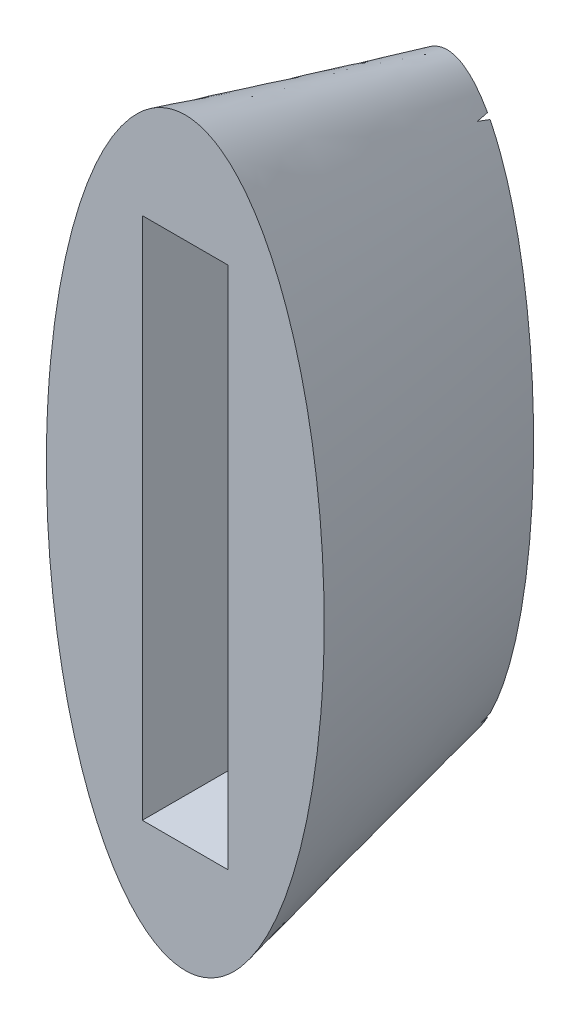
ISO-10303-21;
HEADER;
FILE_DESCRIPTION(('STEP AP214'),'2;1');
FILE_NAME('part.step','',(''),(''),'','','');
FILE_SCHEMA(('AUTOMOTIVE_DESIGN { 1 0 10303 214 1 1 1 1 }'));
ENDSEC;
DATA;
#1=APPLICATION_CONTEXT('core data for automotive mechanical design processes');
#2=APPLICATION_PROTOCOL_DEFINITION('international standard','automotive_design',2000,#1);
#3=PRODUCT_CONTEXT('',#1,'mechanical');
#4=PRODUCT('Part','Part','',(#3));
#5=PRODUCT_RELATED_PRODUCT_CATEGORY('part','',(#4));
#6=PRODUCT_DEFINITION_FORMATION('','',#4);
#7=PRODUCT_DEFINITION_CONTEXT('part definition',#1,'design');
#8=PRODUCT_DEFINITION('design','',#6,#7);
#9=PRODUCT_DEFINITION_SHAPE('','',#8);
#10=(LENGTH_UNIT() NAMED_UNIT(*) SI_UNIT(.MILLI.,.METRE.));
#11=(NAMED_UNIT(*) PLANE_ANGLE_UNIT() SI_UNIT($,.RADIAN.));
#12=(NAMED_UNIT(*) SI_UNIT($,.STERADIAN.) SOLID_ANGLE_UNIT());
#13=UNCERTAINTY_MEASURE_WITH_UNIT(LENGTH_MEASURE(1.E-05),#10,'distance_accuracy_value','');
#14=(GEOMETRIC_REPRESENTATION_CONTEXT(3) GLOBAL_UNCERTAINTY_ASSIGNED_CONTEXT((#13)) GLOBAL_UNIT_ASSIGNED_CONTEXT((#10,
#11,#12)) REPRESENTATION_CONTEXT('',''));
#15=CARTESIAN_POINT('',(0.,0.,0.));
#16=DIRECTION('',(0.,0.,1.));
#17=DIRECTION('',(1.,0.,0.));
#18=AXIS2_PLACEMENT_3D('',#15,#16,#17);
#19=CARTESIAN_POINT('',(0.,0.,-12.5));
#20=DIRECTION('',(0.,0.,1.));
#21=DIRECTION('',(1.,0.,0.));
#22=AXIS2_PLACEMENT_3D('',#19,#20,#21);
#23=PLANE('',#22);
#24=CARTESIAN_POINT('',(0.,0.,-12.5));
#25=DIRECTION('',(0.,0.,1.));
#26=DIRECTION('',(0.,1.,0.));
#27=AXIS2_PLACEMENT_3D('',#24,#25,#26);
#28=ELLIPSE('',#27,14.1372,4.130055);
#29=CARTESIAN_POINT('',(2.05,-12.2727270886609,-12.5));
#30=VERTEX_POINT('',#29);
#31=CARTESIAN_POINT('',(2.05,12.2727290489737,-12.5));
#32=VERTEX_POINT('',#31);
#33=EDGE_CURVE('E298',#30,#32,#28,.T.);
#34=ORIENTED_EDGE('',*,*,#33,.F.);
#35=DIRECTION('',(0.,1.,0.));
#36=VECTOR('',#35,1.);
#37=CARTESIAN_POINT('',(2.05,0.,-12.5));
#38=LINE('',#37,#36);
#39=EDGE_CURVE('E172',#30,#32,#38,.T.);
#40=ORIENTED_EDGE('',*,*,#39,.T.);
#41=EDGE_LOOP('',(#34,#40));
#42=FACE_BOUND('',#41,.T.);
#43=ADVANCED_FACE('F53',(#42),#23,.F.);
#44=CARTESIAN_POINT('',(-1.92924399157803,-12.5,-12.5));
#45=VERTEX_POINT('',#44);
#46=CARTESIAN_POINT('',(1.92924590420982,-12.5,-12.5));
#47=VERTEX_POINT('',#46);
#48=EDGE_CURVE('E307',#45,#47,#28,.T.);
#49=ORIENTED_EDGE('',*,*,#48,.F.);
#50=DIRECTION('',(1.,0.,0.));
#51=VECTOR('',#50,1.);
#52=CARTESIAN_POINT('',(0.,-12.5,-12.5));
#53=LINE('',#52,#51);
#54=EDGE_CURVE('E166',#45,#47,#53,.T.);
#55=ORIENTED_EDGE('',*,*,#54,.T.);
#56=EDGE_LOOP('',(#49,#55));
#57=FACE_BOUND('',#56,.T.);
#58=ADVANCED_FACE('F352',(#57),#23,.F.);
#59=CARTESIAN_POINT('',(-2.05,12.2727270886608,-12.5));
#60=VERTEX_POINT('',#59);
#61=CARTESIAN_POINT('',(-2.05,-12.2727290489737,-12.5));
#62=VERTEX_POINT('',#61);
#63=EDGE_CURVE('E58',#60,#62,#28,.T.);
#64=ORIENTED_EDGE('',*,*,#63,.F.);
#65=DIRECTION('',(0.,-1.,0.));
#66=VECTOR('',#65,1.);
#67=CARTESIAN_POINT('',(-2.05,0.,-12.5));
#68=LINE('',#67,#66);
#69=EDGE_CURVE('E160',#60,#62,#68,.T.);
#70=ORIENTED_EDGE('',*,*,#69,.T.);
#71=EDGE_LOOP('',(#64,#70));
#72=FACE_BOUND('',#71,.T.);
#73=ADVANCED_FACE('F354',(#72),#23,.F.);
#74=CARTESIAN_POINT('',(0.,0.,0.));
#75=DIRECTION('',(0.,0.,1.));
#76=DIRECTION('',(1.,0.,0.));
#77=AXIS2_PLACEMENT_3D('',#74,#75,#76);
#78=PLANE('',#77);
#79=DIRECTION('',(0.,1.,0.));
#80=VECTOR('',#79,1.);
#81=CARTESIAN_POINT('',(2.05,12.5,0.));
#82=LINE('',#81,#80);
#83=CARTESIAN_POINT('',(2.05,-12.5,0.));
#84=VERTEX_POINT('',#83);
#85=CARTESIAN_POINT('',(2.05,12.5,0.));
#86=VERTEX_POINT('',#85);
#87=EDGE_CURVE('E73',#84,#86,#82,.T.);
#88=ORIENTED_EDGE('',*,*,#87,.F.);
#89=DIRECTION('',(1.,0.,0.));
#90=VECTOR('',#89,1.);
#91=CARTESIAN_POINT('',(-2.05,-12.5,0.));
#92=LINE('',#91,#90);
#93=CARTESIAN_POINT('',(-2.05,-12.5,0.));
#94=VERTEX_POINT('',#93);
#95=EDGE_CURVE('E142',#94,#84,#92,.T.);
#96=ORIENTED_EDGE('',*,*,#95,.F.);
#97=DIRECTION('',(0.,-1.,0.));
#98=VECTOR('',#97,1.);
#99=CARTESIAN_POINT('',(-2.05,12.5,0.));
#100=LINE('',#99,#98);
#101=CARTESIAN_POINT('',(-2.05,12.5,0.));
#102=VERTEX_POINT('',#101);
#103=EDGE_CURVE('E125',#102,#94,#100,.T.);
#104=ORIENTED_EDGE('',*,*,#103,.F.);
#105=DIRECTION('',(-1.,0.,0.));
#106=VECTOR('',#105,1.);
#107=CARTESIAN_POINT('',(-2.05,12.5,0.));
#108=LINE('',#107,#106);
#109=EDGE_CURVE('E135',#86,#102,#108,.T.);
#110=ORIENTED_EDGE('',*,*,#109,.F.);
#111=EDGE_LOOP('',(#88,#96,#104,#110));
#112=FACE_BOUND('',#111,.T.);
#113=CARTESIAN_POINT('',(0.,0.,0.));
#114=DIRECTION('',(0.,0.,1.));
#115=DIRECTION('',(0.,1.,0.));
#116=AXIS2_PLACEMENT_3D('',#113,#114,#115);
#117=ELLIPSE('',#116,17.6875,6.630055);
#118=CARTESIAN_POINT('',(0.,17.6875,0.));
#119=VERTEX_POINT('',#118);
#120=EDGE_CURVE('E311',#119,#119,#117,.T.);
#121=ORIENTED_EDGE('',*,*,#120,.T.);
#122=EDGE_LOOP('',(#121));
#123=FACE_BOUND('',#122,.T.);
#124=ADVANCED_FACE('F55',(#112,#123),#78,.T.);
#125=CARTESIAN_POINT('',(1.92924399157938,12.5,-12.5));
#126=VERTEX_POINT('',#125);
#127=CARTESIAN_POINT('',(-1.92924590420982,12.5,-12.5));
#128=VERTEX_POINT('',#127);
#129=EDGE_CURVE('E294',#126,#128,#28,.T.);
#130=ORIENTED_EDGE('',*,*,#129,.F.);
#131=DIRECTION('',(-1.,0.,0.));
#132=VECTOR('',#131,1.);
#133=CARTESIAN_POINT('',(0.,12.5,-12.5));
#134=LINE('',#133,#132);
#135=EDGE_CURVE('E152',#126,#128,#134,.T.);
#136=ORIENTED_EDGE('',*,*,#135,.T.);
#137=EDGE_LOOP('',(#130,#136));
#138=FACE_BOUND('',#137,.T.);
#139=ADVANCED_FACE('F200',(#138),#23,.F.);
#140=CARTESIAN_POINT('',(-4.08279544173566,2.13255064071059,-12.5));
#141=CARTESIAN_POINT('',(-6.62728594040557,-0.511144492392694,0.));
#142=CARTESIAN_POINT('',(-5.32880617036933,-25.8183099259914,-12.5));
#143=CARTESIAN_POINT('',(-6.24408694704747,-35.8713700322784,0.));
#144=CARTESIAN_POINT('',(2.83678471310198,-30.0834112074126,-12.5));
#145=CARTESIAN_POINT('',(7.01048493376367,-34.849081047493,0.));
#146=CARTESIAN_POINT('',(4.08279544173566,-2.13255064071059,-12.5));
#147=CARTESIAN_POINT('',(6.62728594040557,0.511144492392696,0.));
#148=CARTESIAN_POINT('',(5.32880617036933,25.8183099259914,-12.5));
#149=CARTESIAN_POINT('',(6.24408694704747,35.8713700322784,0.));
#150=CARTESIAN_POINT('',(-2.83678471310199,30.0834112074126,-12.5));
#151=CARTESIAN_POINT('',(-7.01048493376367,34.849081047493,0.));
#152=CARTESIAN_POINT('',(-4.08279544173566,2.13255064071059,-12.5));
#153=CARTESIAN_POINT('',(-6.62728594040557,-0.511144492392694,0.));
#154=(BOUNDED_SURFACE() B_SPLINE_SURFACE(3,1,((#140,#141),(#142,#143),(#144,#145),(#146,#147),
(#148,#149),(#150,#151),(#152,#153)),.UNSPECIFIED.,.T.,.F.,.F.) B_SPLINE_SURFACE_WITH_KNOTS((4,
3,4),(2,2),(0.,0.5,1.),(0.,1.),
.UNSPECIFIED.) GEOMETRIC_REPRESENTATION_ITEM() RATIONAL_B_SPLINE_SURFACE(((1.,1.),
(0.333333333333333,0.333333333333333),(0.333333333333333,0.333333333333333),(1.,1.),
(0.333333333333333,0.333333333333333),(0.333333333333333,0.333333333333333),(1.,1.))) REPRESENTATION_ITEM('') SURFACE());
#155=CARTESIAN_POINT('',(2.05,-12.2727290489736,-12.5));
#156=CARTESIAN_POINT('',(2.05,-12.3111027775344,-12.4143688326618));
#157=CARTESIAN_POINT('',(2.05,-12.3492288877336,-12.3286284114438));
#158=CARTESIAN_POINT('',(2.05,-12.424985871409,-12.1569290612481));
#159=CARTESIAN_POINT('',(2.05,-12.4626167448853,-12.0709701322705));
#160=CARTESIAN_POINT('',(2.05,-12.5,-11.984901949413));
#161=B_SPLINE_CURVE_WITH_KNOTS('',3,(#155,#156,#157,#158,#159,#160),.UNSPECIFIED.,.F.,.F.,(4,2,
4),(0.,0.281505205966259,0.563010411932515),.UNSPECIFIED.);
#162=CARTESIAN_POINT('',(2.05,-12.5,-11.984901949413));
#163=VERTEX_POINT('',#162);
#164=EDGE_CURVE('E12',#30,#163,#161,.T.);
#165=CARTESIAN_POINT('',(2.05,12.5,-11.8953005782408));
#166=CARTESIAN_POINT('',(2.05,12.4622153813034,-11.9961190965939));
#167=CARTESIAN_POINT('',(2.05,12.4243838260362,-12.0969199742503));
#168=CARTESIAN_POINT('',(2.05,12.3486268423607,-12.29848644817));
#169=CARTESIAN_POINT('',(2.05,12.3107014139525,-12.3992520444333));
#170=CARTESIAN_POINT('',(2.05,12.2727290489737,-12.5));
#171=B_SPLINE_CURVE_WITH_KNOTS('',3,(#165,#166,#167,#168,#169,#170),.UNSPECIFIED.,.F.,.F.,(4,2,
4),(0.,0.322999058190885,0.645998116381772),.UNSPECIFIED.);
#172=CARTESIAN_POINT('',(2.05,12.5,-11.8953005782408));
#173=VERTEX_POINT('',#172);
#174=EDGE_CURVE('E327',#173,#32,#171,.T.);
#175=CARTESIAN_POINT('',(1.92924590420982,12.5,-12.5));
#176=CARTESIAN_POINT('',(1.94925491746777,12.5,-12.399193465011));
#177=CARTESIAN_POINT('',(1.9693222654126,12.5,-12.2983985790366));
#178=CARTESIAN_POINT('',(2.00957363067599,12.5,-12.0968321051169));
#179=CARTESIAN_POINT('',(2.02975764799456,12.5,-11.9960605171716));
#180=CARTESIAN_POINT('',(2.05,12.5,-11.8953005782408));
#181=B_SPLINE_CURVE_WITH_KNOTS('',3,(#175,#176,#177,#178,#179,#180),.UNSPECIFIED.,.F.,.F.,(4,2,
4),(0.,0.308319262176751,0.616638524353501),.UNSPECIFIED.);
#182=EDGE_CURVE('E342',#126,#173,#181,.T.);
#183=CARTESIAN_POINT('',(-2.05,12.5,-11.984901949413));
#184=CARTESIAN_POINT('',(-2.02996878243648,12.5,-12.0707737698944));
#185=CARTESIAN_POINT('',(-2.00989033233887,12.5,-12.156634517684));
#186=CARTESIAN_POINT('',(-1.96963896707547,12.5,-12.3283338678796));
#187=CARTESIAN_POINT('',(-1.94946605190969,12.5,-12.4141724702857));
#188=CARTESIAN_POINT('',(-1.92924590420982,12.5,-12.5));
#189=B_SPLINE_CURVE_WITH_KNOTS('',3,(#183,#184,#185,#186,#187,#188),.UNSPECIFIED.,.F.,.F.,(4,2,
4),(0.,0.264531490608989,0.52906298121798),.UNSPECIFIED.);
#190=CARTESIAN_POINT('',(-2.05,12.5,-11.984901949413));
#191=VERTEX_POINT('',#190);
#192=EDGE_CURVE('E318',#191,#128,#189,.T.);
#193=CARTESIAN_POINT('',(-2.05,12.2727290489737,-12.5));
#194=CARTESIAN_POINT('',(-2.05,12.3111027775344,-12.4143688326618));
#195=CARTESIAN_POINT('',(-2.05,12.3492288877336,-12.3286284114438));
#196=CARTESIAN_POINT('',(-2.05,12.424985871409,-12.1569290612481));
#197=CARTESIAN_POINT('',(-2.05,12.4626167448853,-12.0709701322705));
#198=CARTESIAN_POINT('',(-2.05,12.5,-11.984901949413));
#199=B_SPLINE_CURVE_WITH_KNOTS('',3,(#193,#194,#195,#196,#197,#198),.UNSPECIFIED.,.F.,.F.,(4,2,
4),(0.,0.281505205966247,0.563010411932495),.UNSPECIFIED.);
#200=EDGE_CURVE('E128',#60,#191,#199,.T.);
#201=CARTESIAN_POINT('',(-2.05,-12.5,-11.8953005782408));
#202=CARTESIAN_POINT('',(-2.05,-12.4622153813034,-11.9961190965938));
#203=CARTESIAN_POINT('',(-2.05,-12.4243838260362,-12.0969199742503));
#204=CARTESIAN_POINT('',(-2.05,-12.3486268423607,-12.29848644817));
#205=CARTESIAN_POINT('',(-2.05,-12.3107014139525,-12.3992520444333));
#206=CARTESIAN_POINT('',(-2.05,-12.2727290489737,-12.5));
#207=B_SPLINE_CURVE_WITH_KNOTS('',3,(#201,#202,#203,#204,#205,#206),.UNSPECIFIED.,.F.,.F.,(4,2,
4),(0.,0.322999058190903,0.645998116381806),.UNSPECIFIED.);
#208=CARTESIAN_POINT('',(-2.05,-12.5,-11.8953005782408));
#209=VERTEX_POINT('',#208);
#210=EDGE_CURVE('E345',#209,#62,#207,.T.);
#211=CARTESIAN_POINT('',(-1.92924590420982,-12.5,-12.5));
#212=CARTESIAN_POINT('',(-1.94925491746777,-12.5,-12.399193465011));
#213=CARTESIAN_POINT('',(-1.9693222654126,-12.5,-12.2983985790366));
#214=CARTESIAN_POINT('',(-2.00957363067599,-12.5,-12.0968321051169));
#215=CARTESIAN_POINT('',(-2.02975764799456,-12.5,-11.9960605171715));
#216=CARTESIAN_POINT('',(-2.05,-12.5,-11.8953005782408));
#217=B_SPLINE_CURVE_WITH_KNOTS('',3,(#211,#212,#213,#214,#215,#216),.UNSPECIFIED.,.F.,.F.,(4,2,
4),(0.,0.308319262176767,0.616638524353531),.UNSPECIFIED.);
#218=EDGE_CURVE('E347',#45,#209,#217,.T.);
#219=CARTESIAN_POINT('',(2.05,-12.5,-11.984901949413));
#220=CARTESIAN_POINT('',(2.02996878243648,-12.5,-12.0707737698943));
#221=CARTESIAN_POINT('',(2.00989033233887,-12.5,-12.156634517684));
#222=CARTESIAN_POINT('',(1.96963896707547,-12.5,-12.3283338678796));
#223=CARTESIAN_POINT('',(1.94946605190969,-12.5,-12.4141724702857));
#224=CARTESIAN_POINT('',(1.92924590420982,-12.5,-12.5));
#225=B_SPLINE_CURVE_WITH_KNOTS('',3,(#219,#220,#221,#222,#223,#224),.UNSPECIFIED.,.F.,.F.,(4,2,
4),(0.,0.264531490608999,0.529062981217999),.UNSPECIFIED.);
#226=EDGE_CURVE('E65',#163,#47,#225,.T.);
#227=ORIENTED_EDGE('',*,*,#164,.F.);
#228=ORIENTED_EDGE('',*,*,#33,.T.);
#229=ORIENTED_EDGE('',*,*,#174,.F.);
#230=ORIENTED_EDGE('',*,*,#182,.F.);
#231=ORIENTED_EDGE('',*,*,#129,.T.);
#232=ORIENTED_EDGE('',*,*,#192,.F.);
#233=ORIENTED_EDGE('',*,*,#200,.F.);
#234=ORIENTED_EDGE('',*,*,#63,.T.);
#235=ORIENTED_EDGE('',*,*,#210,.F.);
#236=ORIENTED_EDGE('',*,*,#218,.F.);
#237=ORIENTED_EDGE('',*,*,#48,.T.);
#238=ORIENTED_EDGE('',*,*,#226,.F.);
#239=EDGE_LOOP('',(#227,#228,#229,#230,#231,#232,#233,#234,#235,#236,#237,#238));
#240=FACE_BOUND('',#239,.T.);
#241=ORIENTED_EDGE('',*,*,#120,.F.);
#242=EDGE_LOOP('',(#241));
#243=FACE_BOUND('',#242,.T.);
#244=ADVANCED_FACE('F188',(#240,#243),#154,.T.);
#245=CARTESIAN_POINT('',(2.05,12.5,-20.));
#246=DIRECTION('',(1.,0.,0.));
#247=DIRECTION('',(0.,1.,0.));
#248=AXIS2_PLACEMENT_3D('',#245,#246,#247);
#249=PLANE('',#248);
#250=ORIENTED_EDGE('',*,*,#164,.T.);
#251=DIRECTION('',(0.,0.,1.));
#252=VECTOR('',#251,1.);
#253=CARTESIAN_POINT('',(2.05,-12.5,-20.));
#254=LINE('',#253,#252);
#255=EDGE_CURVE('E149',#163,#84,#254,.T.);
#256=ORIENTED_EDGE('',*,*,#255,.T.);
#257=ORIENTED_EDGE('',*,*,#87,.T.);
#258=DIRECTION('',(0.,0.,1.));
#259=VECTOR('',#258,1.);
#260=CARTESIAN_POINT('',(2.05,12.5,-20.));
#261=LINE('',#260,#259);
#262=EDGE_CURVE('E132',#173,#86,#261,.T.);
#263=ORIENTED_EDGE('',*,*,#262,.F.);
#264=ORIENTED_EDGE('',*,*,#174,.T.);
#265=ORIENTED_EDGE('',*,*,#39,.F.);
#266=EDGE_LOOP('',(#250,#256,#257,#263,#264,#265));
#267=FACE_BOUND('',#266,.T.);
#268=ADVANCED_FACE('F199',(#267),#249,.F.);
#269=CARTESIAN_POINT('',(-2.05,-12.5,-20.));
#270=DIRECTION('',(0.,-1.,0.));
#271=DIRECTION('',(0.,0.,-1.));
#272=AXIS2_PLACEMENT_3D('',#269,#270,#271);
#273=PLANE('',#272);
#274=ORIENTED_EDGE('',*,*,#218,.T.);
#275=DIRECTION('',(0.,0.,1.));
#276=VECTOR('',#275,1.);
#277=CARTESIAN_POINT('',(-2.05,-12.5,-20.));
#278=LINE('',#277,#276);
#279=EDGE_CURVE('E131',#209,#94,#278,.T.);
#280=ORIENTED_EDGE('',*,*,#279,.T.);
#281=ORIENTED_EDGE('',*,*,#95,.T.);
#282=ORIENTED_EDGE('',*,*,#255,.F.);
#283=ORIENTED_EDGE('',*,*,#226,.T.);
#284=ORIENTED_EDGE('',*,*,#54,.F.);
#285=EDGE_LOOP('',(#274,#280,#281,#282,#283,#284));
#286=FACE_BOUND('',#285,.T.);
#287=ADVANCED_FACE('F274',(#286),#273,.F.);
#288=CARTESIAN_POINT('',(-2.05,12.5,-20.));
#289=DIRECTION('',(-1.,0.,0.));
#290=DIRECTION('',(0.,-1.,0.));
#291=AXIS2_PLACEMENT_3D('',#288,#289,#290);
#292=PLANE('',#291);
#293=ORIENTED_EDGE('',*,*,#200,.T.);
#294=DIRECTION('',(0.,0.,1.));
#295=VECTOR('',#294,1.);
#296=CARTESIAN_POINT('',(-2.05,12.5,-20.));
#297=LINE('',#296,#295);
#298=EDGE_CURVE('E81',#191,#102,#297,.T.);
#299=ORIENTED_EDGE('',*,*,#298,.T.);
#300=ORIENTED_EDGE('',*,*,#103,.T.);
#301=ORIENTED_EDGE('',*,*,#279,.F.);
#302=ORIENTED_EDGE('',*,*,#210,.T.);
#303=ORIENTED_EDGE('',*,*,#69,.F.);
#304=EDGE_LOOP('',(#293,#299,#300,#301,#302,#303));
#305=FACE_BOUND('',#304,.T.);
#306=ADVANCED_FACE('F122',(#305),#292,.F.);
#307=CARTESIAN_POINT('',(-2.05,12.5,-20.));
#308=DIRECTION('',(0.,1.,0.));
#309=DIRECTION('',(0.,0.,1.));
#310=AXIS2_PLACEMENT_3D('',#307,#308,#309);
#311=PLANE('',#310);
#312=ORIENTED_EDGE('',*,*,#182,.T.);
#313=ORIENTED_EDGE('',*,*,#262,.T.);
#314=ORIENTED_EDGE('',*,*,#109,.T.);
#315=ORIENTED_EDGE('',*,*,#298,.F.);
#316=ORIENTED_EDGE('',*,*,#192,.T.);
#317=ORIENTED_EDGE('',*,*,#135,.F.);
#318=EDGE_LOOP('',(#312,#313,#314,#315,#316,#317));
#319=FACE_BOUND('',#318,.T.);
#320=ADVANCED_FACE('F136',(#319),#311,.F.);
#321=CLOSED_SHELL('',(#43,#58,#73,#124,#139,#244,#268,#287,#306,#320));
#322=MANIFOLD_SOLID_BREP('B2',#321);
#323=ADVANCED_BREP_SHAPE_REPRESENTATION('',(#18,#322),#14);
#324=SHAPE_DEFINITION_REPRESENTATION(#9,#323);
ENDSEC;
END-ISO-10303-21;
